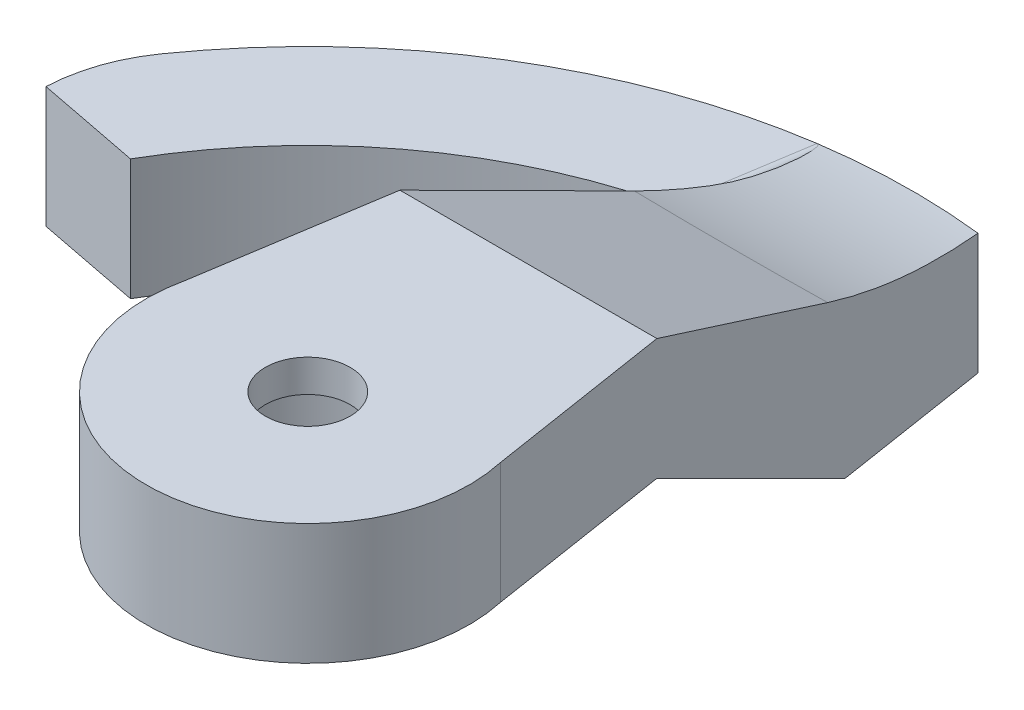
ISO-10303-21;
HEADER;
FILE_DESCRIPTION(('STEP AP214'),'2;1');
FILE_NAME('part.step','',(''),(''),'','','');
FILE_SCHEMA(('AUTOMOTIVE_DESIGN { 1 0 10303 214 1 1 1 1 }'));
ENDSEC;
DATA;
#1=APPLICATION_CONTEXT('core data for automotive mechanical design processes');
#2=APPLICATION_PROTOCOL_DEFINITION('international standard','automotive_design',2000,#1);
#3=PRODUCT_CONTEXT('',#1,'mechanical');
#4=PRODUCT('Part','Part','',(#3));
#5=PRODUCT_RELATED_PRODUCT_CATEGORY('part','',(#4));
#6=PRODUCT_DEFINITION_FORMATION('','',#4);
#7=PRODUCT_DEFINITION_CONTEXT('part definition',#1,'design');
#8=PRODUCT_DEFINITION('design','',#6,#7);
#9=PRODUCT_DEFINITION_SHAPE('','',#8);
#10=(LENGTH_UNIT() NAMED_UNIT(*) SI_UNIT(.MILLI.,.METRE.));
#11=(NAMED_UNIT(*) PLANE_ANGLE_UNIT() SI_UNIT($,.RADIAN.));
#12=(NAMED_UNIT(*) SI_UNIT($,.STERADIAN.) SOLID_ANGLE_UNIT());
#13=UNCERTAINTY_MEASURE_WITH_UNIT(LENGTH_MEASURE(1.E-05),#10,'distance_accuracy_value','');
#14=(GEOMETRIC_REPRESENTATION_CONTEXT(3) GLOBAL_UNCERTAINTY_ASSIGNED_CONTEXT((#13)) GLOBAL_UNIT_ASSIGNED_CONTEXT((#10,
#11,#12)) REPRESENTATION_CONTEXT('',''));
#15=CARTESIAN_POINT('',(0.,0.,0.));
#16=DIRECTION('',(0.,0.,1.));
#17=DIRECTION('',(1.,0.,0.));
#18=AXIS2_PLACEMENT_3D('',#15,#16,#17);
#19=CARTESIAN_POINT('',(-2.,-5.7,-13.));
#20=DIRECTION('',(-0.987897298785657,0.,-0.155109403493158));
#21=DIRECTION('',(0.155109403493158,0.,-0.987897298785657));
#22=AXIS2_PLACEMENT_3D('',#19,#20,#21);
#23=PLANE('',#22);
#24=DIRECTION('',(0.,-1.,0.));
#25=VECTOR('',#24,1.);
#26=CARTESIAN_POINT('',(-2.30186379785542,-5.7,-11.0774187522699));
#27=LINE('',#26,#25);
#28=CARTESIAN_POINT('',(-2.30186379785542,-5.7,-11.0774187522699));
#29=VERTEX_POINT('',#28);
#30=CARTESIAN_POINT('',(-2.30186379785542,-2.2,-11.0774187522699));
#31=VERTEX_POINT('',#30);
#32=EDGE_CURVE('E154',#29,#31,#27,.F.);
#33=ORIENTED_EDGE('',*,*,#32,.F.);
#34=DIRECTION('',(0.155109403493158,0.,-0.987897298785657));
#35=VECTOR('',#34,1.);
#36=CARTESIAN_POINT('',(-2.,-5.7,-13.));
#37=LINE('',#36,#35);
#38=CARTESIAN_POINT('',(-2.31401928861193,-5.7,-11.));
#39=VERTEX_POINT('',#38);
#40=EDGE_CURVE('E187',#39,#29,#37,.T.);
#41=ORIENTED_EDGE('',*,*,#40,.F.);
#42=DIRECTION('',(-0.134685581057554,0.495993308955759,0.857817248442992));
#43=VECTOR('',#42,1.);
#44=CARTESIAN_POINT('',(-2.07725168501319,-6.57192070777256,-12.5079812749422));
#45=LINE('',#44,#43);
#46=CARTESIAN_POINT('',(-3.18297024339712,-2.5,-5.46562051250893));
#47=VERTEX_POINT('',#46);
#48=EDGE_CURVE('E177',#39,#47,#45,.T.);
#49=ORIENTED_EDGE('',*,*,#48,.T.);
#50=DIRECTION('',(-0.155109403493158,0.,0.987897298785657));
#51=VECTOR('',#50,1.);
#52=CARTESIAN_POINT('',(-2.,-2.5,-13.));
#53=LINE('',#52,#51);
#54=CARTESIAN_POINT('',(-3.90521460720455,-2.5,-0.86562051250893));
#55=VERTEX_POINT('',#54);
#56=EDGE_CURVE('E212',#47,#55,#53,.T.);
#57=ORIENTED_EDGE('',*,*,#56,.T.);
#58=DIRECTION('',(0.,1.,0.));
#59=VECTOR('',#58,1.);
#60=CARTESIAN_POINT('',(-3.90521460720455,-5.7,-0.86562051250893));
#61=LINE('',#60,#59);
#62=CARTESIAN_POINT('',(-3.90521460720455,0.5,-0.86562051250893));
#63=VERTEX_POINT('',#62);
#64=EDGE_CURVE('E192',#55,#63,#61,.T.);
#65=ORIENTED_EDGE('',*,*,#64,.T.);
#66=DIRECTION('',(0.155109403493158,0.,-0.987897298785657));
#67=VECTOR('',#66,1.);
#68=CARTESIAN_POINT('',(-2.,0.5,-13.));
#69=LINE('',#68,#67);
#70=CARTESIAN_POINT('',(-3.18297024339712,0.5,-5.46562051250893));
#71=VERTEX_POINT('',#70);
#72=EDGE_CURVE('E186',#63,#71,#69,.T.);
#73=ORIENTED_EDGE('',*,*,#72,.T.);
#74=DIRECTION('',(0.143029556759345,-0.386902869437822,-0.910960325982425));
#75=VECTOR('',#74,1.);
#76=CARTESIAN_POINT('',(-1.83398436222617,-3.14908149113766,-14.0573594921998));
#77=LINE('',#76,#75);
#78=CARTESIAN_POINT('',(-2.3947349918283,-1.63221999378175,-10.4859188199988));
#79=VERTEX_POINT('',#78);
#80=EDGE_CURVE('E215',#71,#79,#77,.T.);
#81=ORIENTED_EDGE('',*,*,#80,.T.);
#82=CARTESIAN_POINT('',(5.48061028243497,-1.74980033179134,-10.7627609721337));
#83=CARTESIAN_POINT('',(5.13318644290078,-2.45489766446139,-12.4229081221193));
#84=CARTESIAN_POINT('',(4.79752133187451,-2.7,-14.2121000935896));
#85=CARTESIAN_POINT('',(5.30743555571062,-1.73679045887222,-10.732129309741));
#86=CARTESIAN_POINT('',(4.98275489532584,-2.45684589057673,-12.4274952080194));
#87=CARTESIAN_POINT('',(4.66957807039711,-2.7,-14.2553098999343));
#88=CARTESIAN_POINT('',(5.13355004313864,-1.72536404652655,-10.7052258951182));
#89=CARTESIAN_POINT('',(4.83000879640661,-2.45948374365066,-12.4337060161729));
#90=CARTESIAN_POINT('',(4.5375825006336,-2.7,-14.2979229890706));
#91=CARTESIAN_POINT('',(4.78487641736793,-1.70511022915286,-10.6575384119421));
#92=CARTESIAN_POINT('',(4.52058800058379,-2.46568324812962,-12.4483027097288));
#93=CARTESIAN_POINT('',(4.2666029322981,-2.7,-14.3810992926904));
#94=CARTESIAN_POINT('',(4.61008883466798,-1.69628144206755,-10.6367510893436));
#95=CARTESIAN_POINT('',(4.3639174004254,-2.46924486693202,-12.4566885183685));
#96=CARTESIAN_POINT('',(4.12762269614675,-2.7,-14.4216635876764));
#97=CARTESIAN_POINT('',(4.26021107082828,-1.68065422042625,-10.5999568961622));
#98=CARTESIAN_POINT('',(4.04753328671518,-2.4768320871263,-12.4745525796807));
#99=CARTESIAN_POINT('',(3.84386753885221,-2.7,-14.4998741196542));
#100=CARTESIAN_POINT('',(4.08512175555619,-1.67385271511692,-10.5839427955101));
#101=CARTESIAN_POINT('',(3.88782916350045,-2.48085708585206,-12.4840294133796));
#102=CARTESIAN_POINT('',(3.69910176229509,-2.7,-14.5375247053706));
#103=CARTESIAN_POINT('',(3.73456318690505,-1.66185087662426,-10.5556845437128));
#104=CARTESIAN_POINT('',(3.56564356805643,-2.48904026006899,-12.5032966446179));
#105=CARTESIAN_POINT('',(3.40440985128987,-2.7,-14.6093468722419));
#106=CARTESIAN_POINT('',(3.55909387973761,-1.65665078738379,-10.5434409669295));
#107=CARTESIAN_POINT('',(3.40316823264915,-2.49319832136314,-12.5130867732811));
#108=CARTESIAN_POINT('',(3.25448293451143,-2.7,-14.6435179228311));
#109=CARTESIAN_POINT('',(3.03321376623377,-1.6429563259312,-10.5111974452231));
#110=CARTESIAN_POINT('',(2.91297122851741,-2.50542068457699,-12.5418642491209));
#111=CARTESIAN_POINT('',(2.79890427974513,-2.7,-14.7398145458714));
#112=CARTESIAN_POINT('',(2.68248917420221,-1.6363337370781,-10.4956046022203));
#113=CARTESIAN_POINT('',(2.58198863640697,-2.51324686639929,-12.5602909440544));
#114=CARTESIAN_POINT('',(2.4867655762965,-2.7,-14.7959168580991));
#115=CARTESIAN_POINT('',(1.98061873083567,-1.62625520041635,-10.4718747522552));
#116=CARTESIAN_POINT('',(1.91378487759617,-2.52668790765447,-12.5919377895305));
#117=CARTESIAN_POINT('',(1.85071564171932,-2.7,-14.8888647108006));
#118=CARTESIAN_POINT('',(1.62947275888573,-1.62280074580643,-10.4637412610198));
#119=CARTESIAN_POINT('',(1.57664911986699,-2.53229838941505,-12.6051476328717));
#120=CARTESIAN_POINT('',(1.52679893410118,-2.7,-14.9257011674186));
#121=CARTESIAN_POINT('',(0.927700263922301,-1.61807296027599,-10.4526097202942));
#122=CARTESIAN_POINT('',(0.899609908576277,-2.54038939099545,-12.6241978442282));
#123=CARTESIAN_POINT('',(0.873204060730277,-2.7,-14.978144504117));
#124=CARTESIAN_POINT('',(0.577073898452881,-1.61679585005128,-10.4496027724566));
#125=CARTESIAN_POINT('',(0.559813338429111,-2.54287293749757,-12.6300453385475));
#126=CARTESIAN_POINT('',(0.543536883481832,-2.7,-14.9937881596769));
#127=CARTESIAN_POINT('',(-0.124108578102065,-1.61601406279007,-10.4477620593615));
#128=CARTESIAN_POINT('',(-0.120378972612391,-2.54435585727638,-12.6335368636609));
#129=CARTESIAN_POINT('',(-0.116833815050918,-2.7,-15.0031770954783));
#130=CARTESIAN_POINT('',(-0.474664686233908,-1.61650896743314,-10.4489273091712));
#131=CARTESIAN_POINT('',(-0.460667686978426,-2.54335558493671,-12.6311817288491));
#132=CARTESIAN_POINT('',(-0.447537073331416,-2.7,-14.9969275440675));
#133=CARTESIAN_POINT('',(-1.00082128887623,-1.61870869746507,-10.4541065594307));
#134=CARTESIAN_POINT('',(-0.969992608903101,-2.53935751105,-12.6217682895111));
#135=CARTESIAN_POINT('',(-0.940882564694361,-2.7,-14.9713735264812));
#136=CARTESIAN_POINT('',(-1.17644229626345,-1.61968660381244,-10.4564090336571));
#137=CARTESIAN_POINT('',(-1.13972256917356,-2.53760584069683,-12.617643992893));
#138=CARTESIAN_POINT('',(-1.10504781162355,-2.7,-14.960138892166));
#139=CARTESIAN_POINT('',(-1.52765570998141,-1.62221003149571,-10.4623504279618));
#140=CARTESIAN_POINT('',(-1.47832940902747,-2.53334182017711,-12.6076043839124));
#141=CARTESIAN_POINT('',(-1.43169991794988,-2.7,-14.9324172206366));
#142=CARTESIAN_POINT('',(-1.70324811669291,-1.62375554452918,-10.4659893284921));
#143=CARTESIAN_POINT('',(-1.64719372028884,-2.53082979298069,-12.601689831981));
#144=CARTESIAN_POINT('',(-1.59418680186084,-2.7,-14.915930260249));
#145=CARTESIAN_POINT('',(-2.05443752924195,-1.62752130873887,-10.4748557961847));
#146=CARTESIAN_POINT('',(-1.98377635091646,-2.52514178915277,-12.5882974634292));
#147=CARTESIAN_POINT('',(-1.91686886670933,-2.7,-14.8779027942894));
#148=CARTESIAN_POINT('',(-2.23003452210995,-1.62974175221557,-10.4800838161171));
#149=CARTESIAN_POINT('',(-2.15148249973104,-2.52196600967817,-12.5808201110134));
#150=CARTESIAN_POINT('',(-2.07706338086897,-2.7,-14.8563608488558));
#151=CARTESIAN_POINT('',(-2.58115315567372,-1.63502357307548,-10.4925198294745));
#152=CARTESIAN_POINT('',(-2.48534667151388,-2.51509907482426,-12.564651956918));
#153=CARTESIAN_POINT('',(-2.39444022987948,-2.7,-14.8085284222813));
#154=CARTESIAN_POINT('',(-2.75667479242278,-1.63808499013583,-10.4997279163189));
#155=CARTESIAN_POINT('',(-2.65149383445822,-2.511408304459,-12.5559620617515));
#156=CARTESIAN_POINT('',(-2.55162242223467,-2.7,-14.7822377171141));
#157=CARTESIAN_POINT('',(-2.93213553469174,-1.64164997500554,-10.5081216503425));
#158=CARTESIAN_POINT('',(-2.8167189731494,-2.50753325278855,-12.5468382774331));
#159=CARTESIAN_POINT('',(-2.70695427770255,-2.7,-14.7537249038481));
#160=(BOUNDED_SURFACE() B_SPLINE_SURFACE(3,2,((#82,#83,#84),(#85,#86,#87),(#88,#89,#90),(#91,
#92,#93),(#94,#95,#96),(#97,#98,#99),(#100,#101,#102),(#103,#104,#105),(#106,#107,#108),(#109,
#110,#111),(#112,#113,#114),(#115,#116,#117),(#118,#119,#120),(#121,#122,#123),(#124,#125,#126),
(#127,#128,#129),(#130,#131,#132),(#133,#134,#135),(#136,#137,#138),(#139,#140,#141),(#142,#143,
#144),(#145,#146,#147),(#148,#149,#150),(#151,#152,#153),(#154,#155,#156),(#157,#158,#159)),
.UNSPECIFIED.,.F.,.F.,.F.) B_SPLINE_SURFACE_WITH_KNOTS((4,2,2,2,2,2,2,2,2,2,2,2,4),(3,3),(0.,
0.528887227038429,1.05749255053712,1.58529307063587,2.11317395058495,3.16639930707198,
4.220120812917,5.27201146286006,6.323653808833,6.85056560928237,7.37746970285839,
7.90452406233825,8.43160329250523),(0.,1.),
.UNSPECIFIED.) GEOMETRIC_REPRESENTATION_ITEM() RATIONAL_B_SPLINE_SURFACE(((1.,0.991502525096196,
1.),(1.,0.991198306422048,1.),(1.,0.990898142102322,1.),(1.,0.990312000240389,1.),(1.,
0.990026015221729,1.),(1.,0.989474393352266,1.),(1.,0.989208726184226,1.),(1.,0.988701753868574,
1.),(1.,0.988460452436341,1.),(1.,0.987780225788079,1.),(1.,0.987383614501566,1.),(1.,
0.986726260871237,1.),(1.,0.986465582620053,1.),(1.,0.986094396309662,1.),(1.,0.985983628114614,
1.),(1.,0.985917153054352,1.),(1.,0.985961409592318,1.),(1.,0.986142311760186,1.),(1.,
0.986221840373209,1.),(1.,0.986418042866661,1.),(1.,0.986534716203767,1.),(1.,0.986803763150659,
1.),(1.,0.98695614693219,1.),(1.,0.987294407792744,1.),(1.,0.987480286451913,1.),(1.,
0.987681810723772,1.))) REPRESENTATION_ITEM('') SURFACE());
#161=CARTESIAN_POINT('',(-1.7011759251195,-2.7,-14.9032211441619));
#162=CARTESIAN_POINT('',(-1.76090129445513,-2.67224006413915,-14.5228281460145));
#163=CARTESIAN_POINT('',(-1.82045088426288,-2.62877814873787,-14.143554693922));
#164=CARTESIAN_POINT('',(-1.93841740449698,-2.51121057481243,-13.3922217375578));
#165=CARTESIAN_POINT('',(-1.99683920345082,-2.43730789090149,-13.0201312254617));
#166=CARTESIAN_POINT('',(-2.11256416827434,-2.25924203095393,-12.283074815105));
#167=CARTESIAN_POINT('',(-2.16986731495724,-2.15507833637521,-11.9181090390459));
#168=CARTESIAN_POINT('',(-2.28334921264257,-1.91636656865337,-11.1953388029438));
#169=CARTESIAN_POINT('',(-2.33951803513296,-1.78162232056316,-10.8375975779466));
#170=CARTESIAN_POINT('',(-2.3947349918283,-1.63221999378175,-10.4859188199988));
#171=B_SPLINE_CURVE_WITH_KNOTS('',3,(#161,#162,#163,#164,#165,#166,#167,#168,#169,#170),
.UNSPECIFIED.,.F.,.F.,(4,2,2,2,4),(0.,1.15783750004814,2.30807656907647,3.45833534936156,
4.61619279332805),.UNSPECIFIED.);
#172=CARTESIAN_POINT('',(-2.14293288436369,-2.19999999999611,-12.0896553839383));
#173=VERTEX_POINT('',#172);
#174=EDGE_CURVE('E155',#173,#79,#171,.T.);
#175=ORIENTED_EDGE('',*,*,#174,.F.);
#176=DIRECTION('',(0.155109403493158,0.,-0.987897298785657));
#177=VECTOR('',#176,1.);
#178=CARTESIAN_POINT('',(-2.,-2.2,-13.));
#179=LINE('',#178,#177);
#180=EDGE_CURVE('E317',#31,#173,#179,.T.);
#181=ORIENTED_EDGE('',*,*,#180,.F.);
#182=EDGE_LOOP('',(#33,#41,#49,#57,#65,#73,#81,#175,#181));
#183=FACE_BOUND('',#182,.T.);
#184=ADVANCED_FACE('F35',(#183),#23,.T.);
#185=CARTESIAN_POINT('',(0.,0.5,0.));
#186=DIRECTION('',(0.,1.,0.));
#187=DIRECTION('',(0.,0.,1.));
#188=AXIS2_PLACEMENT_3D('',#185,#186,#187);
#189=PLANE('',#188);
#190=DIRECTION('',(-1.,0.,0.));
#191=VECTOR('',#190,1.);
#192=CARTESIAN_POINT('',(6.5,0.5,-5.46562051250893));
#193=LINE('',#192,#191);
#194=CARTESIAN_POINT('',(3.18297024339712,0.5,-5.46562051250893));
#195=VERTEX_POINT('',#194);
#196=EDGE_CURVE('E170',#195,#71,#193,.T.);
#197=ORIENTED_EDGE('',*,*,#196,.T.);
#198=ORIENTED_EDGE('',*,*,#72,.F.);
#199=CARTESIAN_POINT('',(0.,0.5,0.));
#200=DIRECTION('',(0.,-1.,0.));
#201=DIRECTION('',(0.,0.,1.));
#202=AXIS2_PLACEMENT_3D('',#199,#200,#201);
#203=CIRCLE('',#202,4.);
#204=CARTESIAN_POINT('',(3.90521460720455,0.5,-0.86562051250893));
#205=VERTEX_POINT('',#204);
#206=EDGE_CURVE('E210',#205,#63,#203,.T.);
#207=ORIENTED_EDGE('',*,*,#206,.F.);
#208=DIRECTION('',(0.155109403493158,0.,0.987897298785657));
#209=VECTOR('',#208,1.);
#210=CARTESIAN_POINT('',(3.90521460720455,0.5,-0.86562051250893));
#211=LINE('',#210,#209);
#212=EDGE_CURVE('E190',#195,#205,#211,.T.);
#213=ORIENTED_EDGE('',*,*,#212,.F.);
#214=EDGE_LOOP('',(#197,#198,#207,#213));
#215=FACE_BOUND('',#214,.T.);
#216=CARTESIAN_POINT('',(0.,0.5,0.));
#217=DIRECTION('',(0.,-1.,0.));
#218=DIRECTION('',(0.,0.,1.));
#219=AXIS2_PLACEMENT_3D('',#216,#217,#218);
#220=CIRCLE('',#219,1.05);
#221=CARTESIAN_POINT('',(0.,0.5,1.05));
#222=VERTEX_POINT('',#221);
#223=EDGE_CURVE('E207',#222,#222,#220,.T.);
#224=ORIENTED_EDGE('',*,*,#223,.T.);
#225=EDGE_LOOP('',(#224));
#226=FACE_BOUND('',#225,.T.);
#227=ADVANCED_FACE('F328',(#215,#226),#189,.T.);
#228=CARTESIAN_POINT('',(0.,0.5,0.));
#229=DIRECTION('',(0.,-1.,0.));
#230=DIRECTION('',(0.,0.,-1.));
#231=AXIS2_PLACEMENT_3D('',#228,#229,#230);
#232=CYLINDRICAL_SURFACE('',#231,4.);
#233=ORIENTED_EDGE('',*,*,#206,.T.);
#234=ORIENTED_EDGE('',*,*,#64,.F.);
#235=CARTESIAN_POINT('',(0.,-2.5,0.));
#236=DIRECTION('',(0.,1.,0.));
#237=DIRECTION('',(0.,0.,-1.));
#238=AXIS2_PLACEMENT_3D('',#235,#236,#237);
#239=CIRCLE('',#238,4.);
#240=CARTESIAN_POINT('',(3.90521460720455,-2.5,-0.86562051250893));
#241=VERTEX_POINT('',#240);
#242=EDGE_CURVE('E204',#55,#241,#239,.T.);
#243=ORIENTED_EDGE('',*,*,#242,.T.);
#244=DIRECTION('',(0.,1.,0.));
#245=VECTOR('',#244,1.);
#246=CARTESIAN_POINT('',(3.90521460720455,-5.7,-0.86562051250893));
#247=LINE('',#246,#245);
#248=EDGE_CURVE('E197',#241,#205,#247,.T.);
#249=ORIENTED_EDGE('',*,*,#248,.T.);
#250=EDGE_LOOP('',(#233,#234,#243,#249));
#251=FACE_BOUND('',#250,.T.);
#252=ADVANCED_FACE('F332',(#251),#232,.T.);
#253=CARTESIAN_POINT('',(0.,0.5,0.));
#254=DIRECTION('',(0.,-1.,0.));
#255=DIRECTION('',(0.,0.,-1.));
#256=AXIS2_PLACEMENT_3D('',#253,#254,#255);
#257=CYLINDRICAL_SURFACE('',#256,1.05);
#258=ORIENTED_EDGE('',*,*,#223,.F.);
#259=EDGE_LOOP('',(#258));
#260=FACE_BOUND('',#259,.T.);
#261=CARTESIAN_POINT('',(0.,-0.3,0.));
#262=DIRECTION('',(0.,1.,0.));
#263=DIRECTION('',(0.,0.,-1.));
#264=AXIS2_PLACEMENT_3D('',#261,#262,#263);
#265=CIRCLE('',#264,1.05);
#266=CARTESIAN_POINT('',(0.,-0.3,-1.05));
#267=VERTEX_POINT('',#266);
#268=EDGE_CURVE('E286',#267,#267,#265,.T.);
#269=ORIENTED_EDGE('',*,*,#268,.F.);
#270=EDGE_LOOP('',(#269));
#271=FACE_BOUND('',#270,.T.);
#272=ADVANCED_FACE('F366',(#260,#271),#257,.F.);
#273=CARTESIAN_POINT('',(0.,-2.5,0.));
#274=DIRECTION('',(0.,-1.,0.));
#275=DIRECTION('',(0.,0.,-1.));
#276=AXIS2_PLACEMENT_3D('',#273,#274,#275);
#277=PLANE('',#276);
#278=DIRECTION('',(-1.,0.,0.));
#279=VECTOR('',#278,1.);
#280=CARTESIAN_POINT('',(6.5,-2.5,-5.46562051250893));
#281=LINE('',#280,#279);
#282=CARTESIAN_POINT('',(3.18297024339712,-2.5,-5.46562051250893));
#283=VERTEX_POINT('',#282);
#284=EDGE_CURVE('E175',#283,#47,#281,.T.);
#285=ORIENTED_EDGE('',*,*,#284,.F.);
#286=DIRECTION('',(-0.155109403493158,0.,-0.987897298785657));
#287=VECTOR('',#286,1.);
#288=CARTESIAN_POINT('',(3.90521460720455,-2.5,-0.86562051250893));
#289=LINE('',#288,#287);
#290=EDGE_CURVE('E183',#241,#283,#289,.T.);
#291=ORIENTED_EDGE('',*,*,#290,.F.);
#292=ORIENTED_EDGE('',*,*,#242,.F.);
#293=ORIENTED_EDGE('',*,*,#56,.F.);
#294=EDGE_LOOP('',(#285,#291,#292,#293));
#295=FACE_BOUND('',#294,.T.);
#296=CARTESIAN_POINT('',(0.,-2.5,0.));
#297=DIRECTION('',(0.,1.,0.));
#298=DIRECTION('',(0.,0.,-1.));
#299=AXIS2_PLACEMENT_3D('',#296,#297,#298);
#300=CIRCLE('',#299,2.45);
#301=CARTESIAN_POINT('',(0.,-2.5,-2.45));
#302=VERTEX_POINT('',#301);
#303=EDGE_CURVE('E199',#302,#302,#300,.T.);
#304=ORIENTED_EDGE('',*,*,#303,.T.);
#305=EDGE_LOOP('',(#304));
#306=FACE_BOUND('',#305,.T.);
#307=ADVANCED_FACE('F336',(#295,#306),#277,.T.);
#308=CARTESIAN_POINT('',(0.,-2.5,0.));
#309=DIRECTION('',(0.,1.,0.));
#310=DIRECTION('',(0.,0.,1.));
#311=AXIS2_PLACEMENT_3D('',#308,#309,#310);
#312=CYLINDRICAL_SURFACE('',#311,2.45);
#313=CARTESIAN_POINT('',(0.,-0.3,0.));
#314=DIRECTION('',(0.,1.,0.));
#315=DIRECTION('',(0.,0.,-1.));
#316=AXIS2_PLACEMENT_3D('',#313,#314,#315);
#317=CIRCLE('',#316,2.45);
#318=CARTESIAN_POINT('',(0.,-0.3,-2.45));
#319=VERTEX_POINT('',#318);
#320=EDGE_CURVE('E11',#319,#319,#317,.T.);
#321=ORIENTED_EDGE('',*,*,#320,.T.);
#322=EDGE_LOOP('',(#321));
#323=FACE_BOUND('',#322,.T.);
#324=ORIENTED_EDGE('',*,*,#303,.F.);
#325=EDGE_LOOP('',(#324));
#326=FACE_BOUND('',#325,.T.);
#327=ADVANCED_FACE('F360',(#323,#326),#312,.F.);
#328=CARTESIAN_POINT('',(3.90521460720455,-5.7,-0.86562051250893));
#329=DIRECTION('',(0.987897298785657,0.,-0.155109403493158));
#330=DIRECTION('',(0.155109403493158,0.,0.987897298785657));
#331=AXIS2_PLACEMENT_3D('',#328,#329,#330);
#332=PLANE('',#331);
#333=DIRECTION('',(0.155109403493158,0.,0.987897298785657));
#334=VECTOR('',#333,1.);
#335=CARTESIAN_POINT('',(3.90521460720455,-5.7,-0.86562051250893));
#336=LINE('',#335,#334);
#337=CARTESIAN_POINT('',(1.70117592511957,-5.7,-14.9032211441619));
#338=VERTEX_POINT('',#337);
#339=CARTESIAN_POINT('',(2.31401928861193,-5.7,-11.));
#340=VERTEX_POINT('',#339);
#341=EDGE_CURVE('E160',#338,#340,#336,.T.);
#342=ORIENTED_EDGE('',*,*,#341,.F.);
#343=DIRECTION('',(0.,-1.,0.));
#344=VECTOR('',#343,1.);
#345=CARTESIAN_POINT('',(1.70117592511957,-2.7,-14.9032211441619));
#346=LINE('',#345,#344);
#347=CARTESIAN_POINT('',(1.70117592511957,-2.7,-14.9032211441619));
#348=VERTEX_POINT('',#347);
#349=EDGE_CURVE('E139',#348,#338,#346,.T.);
#350=ORIENTED_EDGE('',*,*,#349,.F.);
#351=CARTESIAN_POINT('',(2.3947349918283,-1.63221999378175,-10.4859188199988));
#352=CARTESIAN_POINT('',(2.33951803320332,-1.78162221608531,-10.8375975902365));
#353=CARTESIAN_POINT('',(2.28334921505604,-1.91636672364633,-11.1953387875723));
#354=CARTESIAN_POINT('',(2.16986731939579,-2.15507886552563,-11.9181090107766));
#355=CARTESIAN_POINT('',(2.11256417046988,-2.25924267621586,-12.2830748011216));
#356=CARTESIAN_POINT('',(1.99683918484862,-2.43730776048541,-13.0201313439397));
#357=CARTESIAN_POINT('',(1.93841736755204,-2.51120955834019,-13.3922219728615));
#358=CARTESIAN_POINT('',(1.82045083436971,-2.6287763678734,-14.1435550116935));
#359=CARTESIAN_POINT('',(1.76090125010847,-2.67223841113585,-14.5228284284601));
#360=CARTESIAN_POINT('',(1.70117592511956,-2.7,-14.9032211441619));
#361=B_SPLINE_CURVE_WITH_KNOTS('',3,(#351,#352,#353,#354,#355,#356,#357,#358,#359,#360),
.UNSPECIFIED.,.F.,.F.,(4,2,2,2,4),(0.,1.15785754602695,2.30811640830878,3.45835534204129,
4.61619272426522),.UNSPECIFIED.);
#362=CARTESIAN_POINT('',(2.3947349918283,-1.63221999378175,-10.4859188199988));
#363=VERTEX_POINT('',#362);
#364=EDGE_CURVE('E148',#363,#348,#361,.T.);
#365=ORIENTED_EDGE('',*,*,#364,.F.);
#366=DIRECTION('',(0.143029556759345,0.386902869437822,0.910960325982425));
#367=VECTOR('',#366,1.);
#368=CARTESIAN_POINT('',(3.45400009718383,1.23315075925061,-3.73942174946635));
#369=LINE('',#368,#367);
#370=EDGE_CURVE('E172',#363,#195,#369,.T.);
#371=ORIENTED_EDGE('',*,*,#370,.T.);
#372=ORIENTED_EDGE('',*,*,#212,.T.);
#373=ORIENTED_EDGE('',*,*,#248,.F.);
#374=ORIENTED_EDGE('',*,*,#290,.T.);
#375=DIRECTION('',(-0.134685581057554,-0.495993308955759,-0.857817248442992));
#376=VECTOR('',#375,1.);
#377=CARTESIAN_POINT('',(3.51376566121863,-1.28181233221554,-3.3587727498524));
#378=LINE('',#377,#376);
#379=EDGE_CURVE('E181',#283,#340,#378,.T.);
#380=ORIENTED_EDGE('',*,*,#379,.T.);
#381=EDGE_LOOP('',(#342,#350,#365,#371,#372,#373,#374,#380));
#382=FACE_BOUND('',#381,.T.);
#383=ADVANCED_FACE('F157',(#382),#332,.T.);
#384=CARTESIAN_POINT('',(0.,-5.7,0.));
#385=DIRECTION('',(0.,-1.,0.));
#386=DIRECTION('',(0.,0.,-1.));
#387=AXIS2_PLACEMENT_3D('',#384,#385,#386);
#388=PLANE('',#387);
#389=CARTESIAN_POINT('',(0.,-5.7,0.));
#390=DIRECTION('',(0.,1.,0.));
#391=DIRECTION('',(0.,0.,-1.));
#392=AXIS2_PLACEMENT_3D('',#389,#390,#391);
#393=CIRCLE('',#392,15.);
#394=CARTESIAN_POINT('',(-12.2642213479057,-5.7,-8.6364850911453));
#395=VERTEX_POINT('',#394);
#396=EDGE_CURVE('E285',#338,#395,#393,.T.);
#397=ORIENTED_EDGE('',*,*,#396,.F.);
#398=ORIENTED_EDGE('',*,*,#341,.T.);
#399=DIRECTION('',(-1.,0.,0.));
#400=VECTOR('',#399,1.);
#401=CARTESIAN_POINT('',(6.5,-5.7,-11.));
#402=LINE('',#401,#400);
#403=EDGE_CURVE('E174',#340,#39,#402,.T.);
#404=ORIENTED_EDGE('',*,*,#403,.T.);
#405=ORIENTED_EDGE('',*,*,#40,.T.);
#406=CARTESIAN_POINT('',(-2.79581244724825,-5.7,-11.1549734540165));
#407=DIRECTION('',(0.,1.,0.));
#408=DIRECTION('',(0.,0.,-1.));
#409=AXIS2_PLACEMENT_3D('',#406,#407,#408);
#410=CIRCLE('',#409,0.5);
#411=CARTESIAN_POINT('',(-2.91736951017209,-5.7,-11.6399722998433));
#412=VERTEX_POINT('',#411);
#413=EDGE_CURVE('E43',#412,#29,#410,.F.);
#414=ORIENTED_EDGE('',*,*,#413,.F.);
#415=CARTESIAN_POINT('',(0.,-5.7,0.));
#416=DIRECTION('',(0.,1.,0.));
#417=DIRECTION('',(0.,0.,-1.));
#418=AXIS2_PLACEMENT_3D('',#415,#416,#417);
#419=CIRCLE('',#418,12.);
#420=CARTESIAN_POINT('',(-10.3923048454133,-5.7,-6.00000000000002));
#421=VERTEX_POINT('',#420);
#422=EDGE_CURVE('E298',#412,#421,#419,.T.);
#423=ORIENTED_EDGE('',*,*,#422,.T.);
#424=DIRECTION('',(-0.981627183447664,0.,-0.190808995376546));
#425=VECTOR('',#424,1.);
#426=CARTESIAN_POINT('',(-10.3923048454133,-5.7,-6.00000000000002));
#427=LINE('',#426,#425);
#428=CARTESIAN_POINT('',(-12.9900826209631,-5.7,-6.5049568470825));
#429=VERTEX_POINT('',#428);
#430=EDGE_CURVE('E287',#421,#429,#427,.T.);
#431=ORIENTED_EDGE('',*,*,#430,.T.);
#432=CARTESIAN_POINT('',(-8.99376232179748,-5.7,-6.33342240017322));
#433=DIRECTION('',(0.,1.,0.));
#434=DIRECTION('',(0.,0.,-1.));
#435=AXIS2_PLACEMENT_3D('',#432,#433,#434);
#436=CIRCLE('',#435,4.);
#437=EDGE_CURVE('E220',#395,#429,#436,.T.);
#438=ORIENTED_EDGE('',*,*,#437,.F.);
#439=EDGE_LOOP('',(#397,#398,#404,#405,#414,#423,#431,#438));
#440=FACE_BOUND('',#439,.T.);
#441=ADVANCED_FACE('F312',(#440),#388,.T.);
#442=CARTESIAN_POINT('',(6.5,-2.5,-5.46562051250893));
#443=DIRECTION('',(0.,0.865705219919018,-0.500554165105999));
#444=DIRECTION('',(0.,0.500554165105999,0.865705219919019));
#445=AXIS2_PLACEMENT_3D('',#442,#443,#444);
#446=PLANE('',#445);
#447=ORIENTED_EDGE('',*,*,#379,.F.);
#448=ORIENTED_EDGE('',*,*,#284,.T.);
#449=ORIENTED_EDGE('',*,*,#48,.F.);
#450=ORIENTED_EDGE('',*,*,#403,.F.);
#451=EDGE_LOOP('',(#447,#448,#449,#450));
#452=FACE_BOUND('',#451,.T.);
#453=ADVANCED_FACE('F244',(#452),#446,.F.);
#454=CARTESIAN_POINT('',(6.5,-2.7,-13.));
#455=DIRECTION('',(0.,-0.920423738607019,0.390922167967844));
#456=DIRECTION('',(0.,-0.390922167967844,-0.920423738607019));
#457=AXIS2_PLACEMENT_3D('',#454,#455,#456);
#458=PLANE('',#457);
#459=ORIENTED_EDGE('',*,*,#80,.F.);
#460=ORIENTED_EDGE('',*,*,#196,.F.);
#461=ORIENTED_EDGE('',*,*,#370,.F.);
#462=CARTESIAN_POINT('',(-2.93213553469174,-1.64164997500554,-10.5081216503425));
#463=CARTESIAN_POINT('',(-2.75667479242278,-1.63808499013583,-10.4997279163189));
#464=CARTESIAN_POINT('',(-2.58115315567372,-1.63502357307548,-10.4925198294745));
#465=CARTESIAN_POINT('',(-2.23003452210994,-1.62974175221557,-10.4800838161171));
#466=CARTESIAN_POINT('',(-2.05443752924195,-1.62752130873887,-10.4748557961847));
#467=CARTESIAN_POINT('',(-1.70324811669291,-1.62375554452918,-10.4659893284921));
#468=CARTESIAN_POINT('',(-1.52765570998141,-1.62221003149571,-10.4623504279618));
#469=CARTESIAN_POINT('',(-1.17644229626345,-1.61968660381244,-10.4564090336571));
#470=CARTESIAN_POINT('',(-1.00082128887623,-1.61870869746507,-10.4541065594307));
#471=CARTESIAN_POINT('',(-0.474664686233908,-1.61650896743314,-10.4489273091712));
#472=CARTESIAN_POINT('',(-0.124108578102065,-1.61601406279007,-10.4477620593615));
#473=CARTESIAN_POINT('',(0.577073898452881,-1.61679585005128,-10.4496027724566));
#474=CARTESIAN_POINT('',(0.927700263922301,-1.61807296027599,-10.4526097202942));
#475=CARTESIAN_POINT('',(1.62947275888573,-1.62280074580643,-10.4637412610198));
#476=CARTESIAN_POINT('',(1.98061873083567,-1.62625520041635,-10.4718747522552));
#477=CARTESIAN_POINT('',(2.68248917420221,-1.6363337370781,-10.4956046022203));
#478=CARTESIAN_POINT('',(3.03321376623377,-1.6429563259312,-10.5111974452231));
#479=CARTESIAN_POINT('',(3.55909387973761,-1.65665078738379,-10.5434409669295));
#480=CARTESIAN_POINT('',(3.73456318690505,-1.66185087662426,-10.5556845437128));
#481=CARTESIAN_POINT('',(4.08512175555619,-1.67385271511692,-10.5839427955101));
#482=CARTESIAN_POINT('',(4.26021107082828,-1.68065422042625,-10.5999568961622));
#483=CARTESIAN_POINT('',(4.61008883466798,-1.69628144206755,-10.6367510893436));
#484=CARTESIAN_POINT('',(4.78487641736793,-1.70511022915286,-10.6575384119421));
#485=CARTESIAN_POINT('',(5.13355004313864,-1.72536404652655,-10.7052258951182));
#486=CARTESIAN_POINT('',(5.30743555571062,-1.73679045887222,-10.732129309741));
#487=CARTESIAN_POINT('',(5.48061028243497,-1.74980033179134,-10.7627609721337));
#488=B_SPLINE_CURVE_WITH_KNOTS('',3,(#462,#463,#464,#465,#466,#467,#468,#469,#470,#471,#472,
#473,#474,#475,#476,#477,#478,#479,#480,#481,#482,#483,#484,#485,#486,#487),.UNSPECIFIED.,.F.,
.F.,(4,2,2,2,2,2,2,2,2,2,2,2,4),(0.,0.527079230166986,1.05413358964684,1.58103768322286,
2.10794948367224,3.15959182964517,4.21148247958823,5.26520398543326,6.31842934192028,
6.84631022186936,7.37411074196811,7.9027160654668,8.43160329250523),.UNSPECIFIED.);
#489=EDGE_CURVE('E151',#79,#363,#488,.T.);
#490=ORIENTED_EDGE('',*,*,#489,.F.);
#491=EDGE_LOOP('',(#459,#460,#461,#490));
#492=FACE_BOUND('',#491,.T.);
#493=ADVANCED_FACE('F238',(#492),#458,.F.);
#494=CARTESIAN_POINT('',(0.,-2.7,0.));
#495=DIRECTION('',(0.,-1.,0.));
#496=DIRECTION('',(0.,0.,-1.));
#497=AXIS2_PLACEMENT_3D('',#494,#495,#496);
#498=CYLINDRICAL_SURFACE('',#497,12.);
#499=CARTESIAN_POINT('',(0.,-2.7,0.));
#500=DIRECTION('',(0.,1.,0.));
#501=DIRECTION('',(0.,0.,-1.));
#502=AXIS2_PLACEMENT_3D('',#499,#500,#501);
#503=CIRCLE('',#502,12.);
#504=CARTESIAN_POINT('',(-2.91736951017209,-2.7,-11.6399722998433));
#505=VERTEX_POINT('',#504);
#506=CARTESIAN_POINT('',(-10.3923048454133,-2.7,-6.00000000000002));
#507=VERTEX_POINT('',#506);
#508=EDGE_CURVE('E162',#505,#507,#503,.T.);
#509=ORIENTED_EDGE('',*,*,#508,.T.);
#510=DIRECTION('',(0.,-1.,0.));
#511=VECTOR('',#510,1.);
#512=CARTESIAN_POINT('',(-10.3923048454133,-2.7,-6.00000000000002));
#513=LINE('',#512,#511);
#514=EDGE_CURVE('E164',#507,#421,#513,.T.);
#515=ORIENTED_EDGE('',*,*,#514,.T.);
#516=ORIENTED_EDGE('',*,*,#422,.F.);
#517=DIRECTION('',(0.,-1.,0.));
#518=VECTOR('',#517,1.);
#519=CARTESIAN_POINT('',(-2.91736951017209,-2.7,-11.6399722998433));
#520=LINE('',#519,#518);
#521=EDGE_CURVE('E282',#505,#412,#520,.T.);
#522=ORIENTED_EDGE('',*,*,#521,.F.);
#523=EDGE_LOOP('',(#509,#515,#516,#522));
#524=FACE_BOUND('',#523,.T.);
#525=ADVANCED_FACE('F243',(#524),#498,.F.);
#526=CARTESIAN_POINT('',(-10.3923048454133,-2.7,-6.00000000000002));
#527=DIRECTION('',(0.190808995376546,0.,-0.981627183447664));
#528=DIRECTION('',(0.981627183447664,0.,0.190808995376546));
#529=AXIS2_PLACEMENT_3D('',#526,#527,#528);
#530=PLANE('',#529);
#531=ORIENTED_EDGE('',*,*,#430,.F.);
#532=ORIENTED_EDGE('',*,*,#514,.F.);
#533=DIRECTION('',(-0.981627183447664,0.,-0.190808995376546));
#534=VECTOR('',#533,1.);
#535=CARTESIAN_POINT('',(-10.3923048454133,-2.7,-6.00000000000002));
#536=LINE('',#535,#534);
#537=CARTESIAN_POINT('',(-12.9900826209631,-2.7,-6.5049568470825));
#538=VERTEX_POINT('',#537);
#539=EDGE_CURVE('E145',#507,#538,#536,.T.);
#540=ORIENTED_EDGE('',*,*,#539,.T.);
#541=DIRECTION('',(0.,-1.,0.));
#542=VECTOR('',#541,1.);
#543=CARTESIAN_POINT('',(-12.9900826209631,-2.7,-6.5049568470825));
#544=LINE('',#543,#542);
#545=EDGE_CURVE('E161',#538,#429,#544,.T.);
#546=ORIENTED_EDGE('',*,*,#545,.T.);
#547=EDGE_LOOP('',(#531,#532,#540,#546));
#548=FACE_BOUND('',#547,.T.);
#549=ADVANCED_FACE('F308',(#548),#530,.F.);
#550=CARTESIAN_POINT('',(0.,-2.7,0.));
#551=DIRECTION('',(0.,-1.,0.));
#552=DIRECTION('',(0.,0.,-1.));
#553=AXIS2_PLACEMENT_3D('',#550,#551,#552);
#554=CYLINDRICAL_SURFACE('',#553,15.);
#555=CARTESIAN_POINT('',(0.,-2.7,0.));
#556=DIRECTION('',(0.,1.,0.));
#557=DIRECTION('',(0.,0.,-1.));
#558=AXIS2_PLACEMENT_3D('',#555,#556,#557);
#559=CIRCLE('',#558,15.);
#560=CARTESIAN_POINT('',(-2.21799547829129,-2.7,-14.8351102475944));
#561=VERTEX_POINT('',#560);
#562=EDGE_CURVE('E134',#348,#561,#559,.T.);
#563=ORIENTED_EDGE('',*,*,#562,.F.);
#564=ORIENTED_EDGE('',*,*,#349,.T.);
#565=ORIENTED_EDGE('',*,*,#396,.T.);
#566=DIRECTION('',(0.,-1.,0.));
#567=VECTOR('',#566,1.);
#568=CARTESIAN_POINT('',(-12.2642213479057,-2.7,-8.6364850911453));
#569=LINE('',#568,#567);
#570=CARTESIAN_POINT('',(-12.2642213479057,-2.7,-8.6364850911453));
#571=VERTEX_POINT('',#570);
#572=EDGE_CURVE('E218',#571,#395,#569,.T.);
#573=ORIENTED_EDGE('',*,*,#572,.F.);
#574=EDGE_CURVE('E143',#561,#571,#559,.T.);
#575=ORIENTED_EDGE('',*,*,#574,.F.);
#576=EDGE_LOOP('',(#563,#564,#565,#573,#575));
#577=FACE_BOUND('',#576,.T.);
#578=ADVANCED_FACE('F136',(#577),#554,.T.);
#579=CARTESIAN_POINT('',(0.,-2.7,0.));
#580=DIRECTION('',(0.,-1.,0.));
#581=DIRECTION('',(0.,0.,-1.));
#582=AXIS2_PLACEMENT_3D('',#579,#580,#581);
#583=PLANE('',#582);
#584=ORIENTED_EDGE('',*,*,#574,.T.);
#585=CARTESIAN_POINT('',(-8.99376232179748,-2.7,-6.33342240017322));
#586=DIRECTION('',(0.,1.,0.));
#587=DIRECTION('',(0.,0.,-1.));
#588=AXIS2_PLACEMENT_3D('',#585,#586,#587);
#589=CIRCLE('',#588,4.);
#590=EDGE_CURVE('E223',#538,#571,#589,.F.);
#591=ORIENTED_EDGE('',*,*,#590,.F.);
#592=ORIENTED_EDGE('',*,*,#539,.F.);
#593=ORIENTED_EDGE('',*,*,#508,.F.);
#594=CARTESIAN_POINT('',(-2.79581244724825,-2.7,-11.1549734540165));
#595=DIRECTION('',(0.,1.,0.));
#596=DIRECTION('',(0.,0.,-1.));
#597=AXIS2_PLACEMENT_3D('',#594,#595,#596);
#598=CIRCLE('',#597,0.5);
#599=CARTESIAN_POINT('',(-2.71825774550167,-2.7,-11.6489221034093));
#600=VERTEX_POINT('',#599);
#601=EDGE_CURVE('E281',#600,#505,#598,.T.);
#602=ORIENTED_EDGE('',*,*,#601,.F.);
#603=DIRECTION('',(0.155109403493158,0.,-0.987897298785657));
#604=VECTOR('',#603,1.);
#605=CARTESIAN_POINT('',(-4.43784888474171,-2.7,-0.696785074876911));
#606=LINE('',#605,#604);
#607=EDGE_CURVE('E316',#561,#600,#606,.F.);
#608=ORIENTED_EDGE('',*,*,#607,.F.);
#609=EDGE_LOOP('',(#584,#591,#592,#593,#602,#608));
#610=FACE_BOUND('',#609,.T.);
#611=ADVANCED_FACE('F342',(#610),#583,.F.);
#612=CARTESIAN_POINT('',(-8.99376232179748,-2.7,-6.33342240017322));
#613=DIRECTION('',(0.,1.,0.));
#614=DIRECTION('',(0.,0.,1.));
#615=AXIS2_PLACEMENT_3D('',#612,#613,#614);
#616=CYLINDRICAL_SURFACE('',#615,4.);
#617=ORIENTED_EDGE('',*,*,#590,.T.);
#618=ORIENTED_EDGE('',*,*,#572,.T.);
#619=ORIENTED_EDGE('',*,*,#437,.T.);
#620=ORIENTED_EDGE('',*,*,#545,.F.);
#621=EDGE_LOOP('',(#617,#618,#619,#620));
#622=FACE_BOUND('',#621,.T.);
#623=ADVANCED_FACE('F254',(#622),#616,.T.);
#624=ORIENTED_EDGE('',*,*,#364,.T.);
#625=ORIENTED_EDGE('',*,*,#562,.T.);
#626=CARTESIAN_POINT('',(-2.14293288436369,-2.2,-12.0896553839383));
#627=CARTESIAN_POINT('',(-2.13046816575559,-2.22277314663444,-12.1691718231564));
#628=CARTESIAN_POINT('',(-2.1194735850781,-2.24489662090023,-12.2490913426071));
#629=CARTESIAN_POINT('',(-2.10007707123808,-2.28779283638965,-12.4095898447849));
#630=CARTESIAN_POINT('',(-2.09167463871352,-2.30856583716468,-12.4901686974213));
#631=CARTESIAN_POINT('',(-2.07711575176776,-2.34870338449489,-12.651808918616));
#632=CARTESIAN_POINT('',(-2.07095760738808,-2.36806898199659,-12.7328698772042));
#633=CARTESIAN_POINT('',(-2.06063732716394,-2.40538258382068,-12.8954443371046));
#634=CARTESIAN_POINT('',(-2.0564752462672,-2.42333054910705,-12.9769578508123));
#635=CARTESIAN_POINT('',(-2.04931589659061,-2.46118998264869,-13.1564999817604));
#636=CARTESIAN_POINT('',(-2.04671110403453,-2.48078901635681,-13.2546103562064));
#637=CARTESIAN_POINT('',(-2.04391957743075,-2.51790243907384,-13.4512556572595));
#638=CARTESIAN_POINT('',(-2.04373286947834,-2.53541680558359,-13.5497905884367));
#639=CARTESIAN_POINT('',(-2.04607430788558,-2.57381259428108,-13.7799615718648));
#640=CARTESIAN_POINT('',(-2.04952424072702,-2.59388173875785,-13.9117277035208));
#641=CARTESIAN_POINT('',(-2.05969545344486,-2.62424340073357,-14.1317602576848));
#642=CARTESIAN_POINT('',(-2.06495108861212,-2.63557010844607,-14.2199503909513));
#643=CARTESIAN_POINT('',(-2.07686666517394,-2.6531003153931,-14.3671892316463));
#644=CARTESIAN_POINT('',(-2.08249267596056,-2.6597618767093,-14.4262616054282));
#645=CARTESIAN_POINT('',(-2.09441324161066,-2.67028668838088,-14.5249197837302));
#646=CARTESIAN_POINT('',(-2.09989122787522,-2.67435396976472,-14.5645771034477));
#647=CARTESIAN_POINT('',(-2.11118912101428,-2.68089527200973,-14.6308581786625));
#648=CARTESIAN_POINT('',(-2.11633522659948,-2.68346174151968,-14.6575807062211));
#649=CARTESIAN_POINT('',(-2.12681129633893,-2.68764900277246,-14.7022718630771));
#650=CARTESIAN_POINT('',(-2.13157953573786,-2.68931435367154,-14.7203624405956));
#651=CARTESIAN_POINT('',(-2.14124128032083,-2.69206499327688,-14.7506404521503));
#652=CARTESIAN_POINT('',(-2.14566468772494,-2.69317394386135,-14.7629650659693));
#653=CARTESIAN_POINT('',(-2.15373625841002,-2.69483305255663,-14.7814909215597));
#654=CARTESIAN_POINT('',(-2.15682368169679,-2.69540819641669,-14.7879303637289));
#655=CARTESIAN_POINT('',(-2.16372516919469,-2.69652703743623,-14.8004071212724));
#656=CARTESIAN_POINT('',(-2.16753632097082,-2.69707084962266,-14.8064459217843));
#657=CARTESIAN_POINT('',(-2.17371047550035,-2.69779432513711,-14.8143986259402));
#658=CARTESIAN_POINT('',(-2.1756172081905,-2.69800098479545,-14.8166597802398));
#659=CARTESIAN_POINT('',(-2.17967861466388,-2.69839909412457,-14.8209580510657));
#660=CARTESIAN_POINT('',(-2.18183357039203,-2.69859052607343,-14.8229949075849));
#661=CARTESIAN_POINT('',(-2.18644434449173,-2.69895192037948,-14.826780533947));
#662=CARTESIAN_POINT('',(-2.18890403626745,-2.69912153525282,-14.8285247506319));
#663=CARTESIAN_POINT('',(-2.19411301473521,-2.69942410027028,-14.8315077696691));
#664=CARTESIAN_POINT('',(-2.19686116338212,-2.69955718752824,-14.8327484707081));
#665=CARTESIAN_POINT('',(-2.20182864703747,-2.69974599147247,-14.8343593865459));
#666=CARTESIAN_POINT('',(-2.20400159498527,-2.6998128098992,-14.8348715730878));
#667=CARTESIAN_POINT('',(-2.20840441213483,-2.69991628271256,-14.8355047420543));
#668=CARTESIAN_POINT('',(-2.21063427625263,-2.69995293978364,-14.8356257592971));
#669=CARTESIAN_POINT('',(-2.21457944393523,-2.69999199470678,-14.8355199401998));
#670=CARTESIAN_POINT('',(-2.21629687262391,-2.7000002726003,-14.8353656994881));
#671=CARTESIAN_POINT('',(-2.21799547829188,-2.7,-14.8351102476161));
#672=B_SPLINE_CURVE_WITH_KNOTS('',3,(#626,#627,#628,#629,#630,#631,#632,#633,#634,#635,#636,
#637,#638,#639,#640,#641,#642,#643,#644,#645,#646,#647,#648,#649,#650,#651,#652,#653,#654,#655,
#656,#657,#658,#659,#660,#661,#662,#663,#664,#665,#666,#667,#668,#669,#670,#671),.UNSPECIFIED.,
.F.,.F.,(4,2,2,2,2,2,2,2,2,2,2,2,2,2,2,2,2,2,2,2,2,2,4),(0.,0.250906537999095,0.501764710107253,
0.752433592735664,1.00310937539358,1.30330064512656,1.60349515443601,2.00334103871976,
2.27048898291752,2.44957842160085,2.57025525265385,2.65220772027106,2.70850862740274,
2.74785571763971,2.76932750939225,2.79071465820127,2.79959625238572,2.80848803612876,
2.81750740875057,2.82649244730146,2.83316042531439,2.83982780979041,2.84498468471829),.UNSPECIFIED.);
#673=EDGE_CURVE('E50',#173,#561,#672,.T.);
#674=ORIENTED_EDGE('',*,*,#673,.F.);
#675=ORIENTED_EDGE('',*,*,#174,.T.);
#676=ORIENTED_EDGE('',*,*,#489,.T.);
#677=EDGE_LOOP('',(#624,#625,#674,#675,#676));
#678=FACE_BOUND('',#677,.T.);
#679=ADVANCED_FACE('F149',(#678),#160,.F.);
#680=CARTESIAN_POINT('',(-2.79581244724825,-2.7,-11.1549734540165));
#681=DIRECTION('',(0.,-1.,0.));
#682=DIRECTION('',(0.,0.,-1.));
#683=AXIS2_PLACEMENT_3D('',#680,#681,#682);
#684=CYLINDRICAL_SURFACE('',#683,0.5);
#685=ORIENTED_EDGE('',*,*,#521,.T.);
#686=ORIENTED_EDGE('',*,*,#413,.T.);
#687=ORIENTED_EDGE('',*,*,#32,.T.);
#688=CARTESIAN_POINT('',(-2.79581244724825,-2.2,-11.1549734540165));
#689=DIRECTION('',(0.109678911035812,0.707106781186547,-0.698548879087211));
#690=DIRECTION('',(0.109678911035812,-0.707106781186547,-0.698548879087211));
#691=AXIS2_PLACEMENT_3D('',#688,#689,#690);
#692=ELLIPSE('',#691,0.707106781186547,0.5);
#693=EDGE_CURVE('E58',#31,#600,#692,.T.);
#694=ORIENTED_EDGE('',*,*,#693,.T.);
#695=ORIENTED_EDGE('',*,*,#601,.T.);
#696=EDGE_LOOP('',(#685,#686,#687,#694,#695));
#697=FACE_BOUND('',#696,.T.);
#698=ADVANCED_FACE('F37',(#697),#684,.F.);
#699=CARTESIAN_POINT('',(-2.49394864939283,-2.2,-13.0775547017466));
#700=DIRECTION('',(0.155109403493158,0.,-0.987897298785657));
#701=DIRECTION('',(0.987897298785657,0.,0.155109403493158));
#702=AXIS2_PLACEMENT_3D('',#699,#700,#701);
#703=CYLINDRICAL_SURFACE('',#702,0.5);
#704=ORIENTED_EDGE('',*,*,#693,.F.);
#705=ORIENTED_EDGE('',*,*,#180,.T.);
#706=ORIENTED_EDGE('',*,*,#673,.T.);
#707=ORIENTED_EDGE('',*,*,#607,.T.);
#708=EDGE_LOOP('',(#704,#705,#706,#707));
#709=FACE_BOUND('',#708,.T.);
#710=ADVANCED_FACE('F271',(#709),#703,.F.);
#711=CARTESIAN_POINT('',(0.,-0.3,0.));
#712=DIRECTION('',(0.,-1.,0.));
#713=DIRECTION('',(0.,0.,-1.));
#714=AXIS2_PLACEMENT_3D('',#711,#712,#713);
#715=PLANE('',#714);
#716=ORIENTED_EDGE('',*,*,#320,.F.);
#717=EDGE_LOOP('',(#716));
#718=FACE_BOUND('',#717,.T.);
#719=ORIENTED_EDGE('',*,*,#268,.T.);
#720=EDGE_LOOP('',(#719));
#721=FACE_BOUND('',#720,.T.);
#722=ADVANCED_FACE('F274',(#718,#721),#715,.T.);
#723=CLOSED_SHELL('',(#184,#227,#252,#272,#307,#327,#383,#441,#453,#493,#525,#549,#578,#611,
#623,#679,#698,#710,#722));
#724=MANIFOLD_SOLID_BREP('B2',#723);
#725=ADVANCED_BREP_SHAPE_REPRESENTATION('',(#18,#724),#14);
#726=SHAPE_DEFINITION_REPRESENTATION(#9,#725);
ENDSEC;
END-ISO-10303-21;
